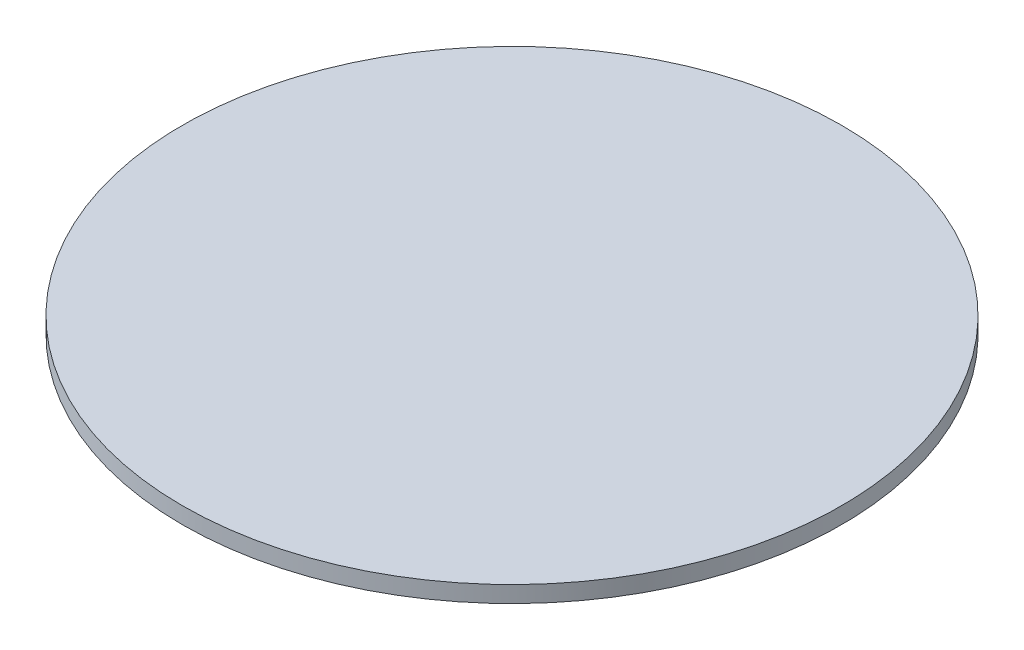
ISO-10303-21;
HEADER;
FILE_DESCRIPTION(('STEP AP214'),'2;1');
FILE_NAME('part.step','',(''),(''),'','','');
FILE_SCHEMA(('AUTOMOTIVE_DESIGN { 1 0 10303 214 1 1 1 1 }'));
ENDSEC;
DATA;
#1=APPLICATION_CONTEXT('core data for automotive mechanical design processes');
#2=APPLICATION_PROTOCOL_DEFINITION('international standard','automotive_design',2000,#1);
#3=PRODUCT_CONTEXT('',#1,'mechanical');
#4=PRODUCT('Part','Part','',(#3));
#5=PRODUCT_RELATED_PRODUCT_CATEGORY('part','',(#4));
#6=PRODUCT_DEFINITION_FORMATION('','',#4);
#7=PRODUCT_DEFINITION_CONTEXT('part definition',#1,'design');
#8=PRODUCT_DEFINITION('design','',#6,#7);
#9=PRODUCT_DEFINITION_SHAPE('','',#8);
#10=(LENGTH_UNIT() NAMED_UNIT(*) SI_UNIT(.MILLI.,.METRE.));
#11=(NAMED_UNIT(*) PLANE_ANGLE_UNIT() SI_UNIT($,.RADIAN.));
#12=(NAMED_UNIT(*) SI_UNIT($,.STERADIAN.) SOLID_ANGLE_UNIT());
#13=UNCERTAINTY_MEASURE_WITH_UNIT(LENGTH_MEASURE(1.E-05),#10,'distance_accuracy_value','');
#14=(GEOMETRIC_REPRESENTATION_CONTEXT(3) GLOBAL_UNCERTAINTY_ASSIGNED_CONTEXT((#13)) GLOBAL_UNIT_ASSIGNED_CONTEXT((#10,
#11,#12)) REPRESENTATION_CONTEXT('',''));
#15=CARTESIAN_POINT('',(0.,0.,0.));
#16=DIRECTION('',(0.,0.,1.));
#17=DIRECTION('',(1.,0.,0.));
#18=AXIS2_PLACEMENT_3D('',#15,#16,#17);
#19=CARTESIAN_POINT('',(0.,6.35,0.));
#20=DIRECTION('',(0.,-1.,0.));
#21=DIRECTION('',(0.,0.,-1.));
#22=AXIS2_PLACEMENT_3D('',#19,#20,#21);
#23=CYLINDRICAL_SURFACE('',#22,127.);
#24=CARTESIAN_POINT('',(0.,6.35,0.));
#25=DIRECTION('',(0.,1.,0.));
#26=DIRECTION('',(0.,0.,1.));
#27=AXIS2_PLACEMENT_3D('',#24,#25,#26);
#28=CIRCLE('',#27,127.);
#29=CARTESIAN_POINT('',(0.,6.35,127.));
#30=VERTEX_POINT('',#29);
#31=EDGE_CURVE('E10',#30,#30,#28,.T.);
#32=ORIENTED_EDGE('',*,*,#31,.F.);
#33=EDGE_LOOP('',(#32));
#34=FACE_BOUND('',#33,.T.);
#35=CARTESIAN_POINT('',(0.,0.,0.));
#36=DIRECTION('',(0.,1.,0.));
#37=DIRECTION('',(0.,0.,1.));
#38=AXIS2_PLACEMENT_3D('',#35,#36,#37);
#39=CIRCLE('',#38,127.);
#40=CARTESIAN_POINT('',(0.,0.,127.));
#41=VERTEX_POINT('',#40);
#42=EDGE_CURVE('E34',#41,#41,#39,.T.);
#43=ORIENTED_EDGE('',*,*,#42,.T.);
#44=EDGE_LOOP('',(#43));
#45=FACE_BOUND('',#44,.T.);
#46=ADVANCED_FACE('F31',(#34,#45),#23,.T.);
#47=CARTESIAN_POINT('',(0.,6.35,0.));
#48=DIRECTION('',(0.,1.,0.));
#49=DIRECTION('',(0.,0.,1.));
#50=AXIS2_PLACEMENT_3D('',#47,#48,#49);
#51=PLANE('',#50);
#52=ORIENTED_EDGE('',*,*,#31,.T.);
#53=EDGE_LOOP('',(#52));
#54=FACE_BOUND('',#53,.T.);
#55=ADVANCED_FACE('F46',(#54),#51,.T.);
#56=CARTESIAN_POINT('',(0.,0.,0.));
#57=DIRECTION('',(0.,1.,0.));
#58=DIRECTION('',(0.,0.,1.));
#59=AXIS2_PLACEMENT_3D('',#56,#57,#58);
#60=PLANE('',#59);
#61=ORIENTED_EDGE('',*,*,#42,.F.);
#62=EDGE_LOOP('',(#61));
#63=FACE_BOUND('',#62,.T.);
#64=ADVANCED_FACE('F44',(#63),#60,.F.);
#65=CLOSED_SHELL('',(#46,#55,#64));
#66=MANIFOLD_SOLID_BREP('B2',#65);
#67=ADVANCED_BREP_SHAPE_REPRESENTATION('',(#18,#66),#14);
#68=SHAPE_DEFINITION_REPRESENTATION(#9,#67);
ENDSEC;
END-ISO-10303-21;
